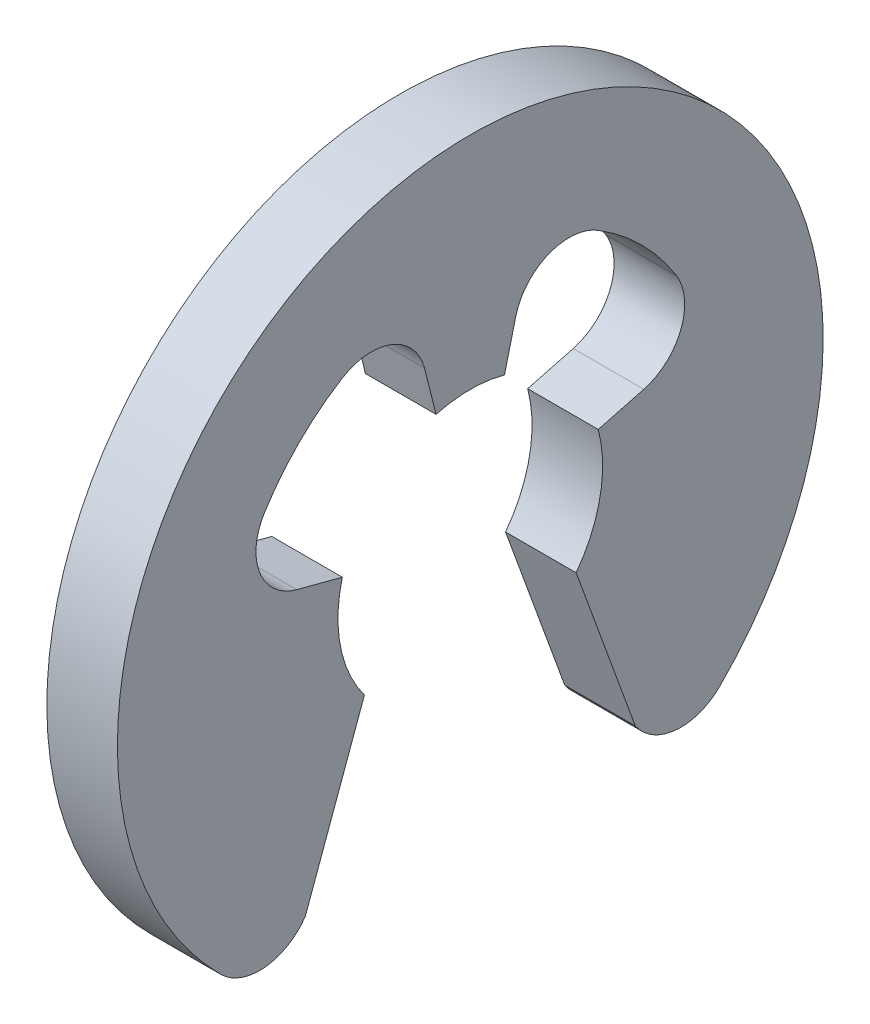
ISO-10303-21;
HEADER;
FILE_DESCRIPTION(('STEP AP214'),'2;1');
FILE_NAME('part.step','',(''),(''),'','','');
FILE_SCHEMA(('AUTOMOTIVE_DESIGN { 1 0 10303 214 1 1 1 1 }'));
ENDSEC;
DATA;
#1=APPLICATION_CONTEXT('core data for automotive mechanical design processes');
#2=APPLICATION_PROTOCOL_DEFINITION('international standard','automotive_design',2000,#1);
#3=PRODUCT_CONTEXT('',#1,'mechanical');
#4=PRODUCT('Part','Part','',(#3));
#5=PRODUCT_RELATED_PRODUCT_CATEGORY('part','',(#4));
#6=PRODUCT_DEFINITION_FORMATION('','',#4);
#7=PRODUCT_DEFINITION_CONTEXT('part definition',#1,'design');
#8=PRODUCT_DEFINITION('design','',#6,#7);
#9=PRODUCT_DEFINITION_SHAPE('','',#8);
#10=(LENGTH_UNIT() NAMED_UNIT(*) SI_UNIT(.MILLI.,.METRE.));
#11=(NAMED_UNIT(*) PLANE_ANGLE_UNIT() SI_UNIT($,.RADIAN.));
#12=(NAMED_UNIT(*) SI_UNIT($,.STERADIAN.) SOLID_ANGLE_UNIT());
#13=UNCERTAINTY_MEASURE_WITH_UNIT(LENGTH_MEASURE(1.E-05),#10,'distance_accuracy_value','');
#14=(GEOMETRIC_REPRESENTATION_CONTEXT(3) GLOBAL_UNCERTAINTY_ASSIGNED_CONTEXT((#13)) GLOBAL_UNIT_ASSIGNED_CONTEXT((#10,
#11,#12)) REPRESENTATION_CONTEXT('',''));
#15=CARTESIAN_POINT('',(0.,0.,0.));
#16=DIRECTION('',(0.,0.,1.));
#17=DIRECTION('',(1.,0.,0.));
#18=AXIS2_PLACEMENT_3D('',#15,#16,#17);
#19=CARTESIAN_POINT('',(0.,0.,0.));
#20=DIRECTION('',(-1.,0.,0.));
#21=DIRECTION('',(0.,0.,1.));
#22=AXIS2_PLACEMENT_3D('',#19,#20,#21);
#23=PLANE('',#22);
#24=CARTESIAN_POINT('',(0.,0.,0.));
#25=DIRECTION('',(-1.,0.,0.));
#26=DIRECTION('',(0.,0.,1.));
#27=AXIS2_PLACEMENT_3D('',#24,#25,#26);
#28=CIRCLE('',#27,0.75);
#29=CARTESIAN_POINT('',(0.,0.190916475736957,0.72529366417485));
#30=VERTEX_POINT('',#29);
#31=CARTESIAN_POINT('',(0.,-0.449999999999999,0.600000000000001));
#32=VERTEX_POINT('',#31);
#33=EDGE_CURVE('E141',#30,#32,#28,.F.);
#34=ORIENTED_EDGE('',*,*,#33,.T.);
#35=DIRECTION('',(0.,-0.939494876468553,0.342562953468903));
#36=VECTOR('',#35,1.);
#37=CARTESIAN_POINT('',(0.,-1.36974839296838,0.935362899612443));
#38=LINE('',#37,#36);
#39=CARTESIAN_POINT('',(0.,-1.36974839296839,0.935362899612445));
#40=VERTEX_POINT('',#39);
#41=EDGE_CURVE('E137',#32,#40,#38,.T.);
#42=ORIENTED_EDGE('',*,*,#41,.T.);
#43=CARTESIAN_POINT('',(0.,-1.1932426932523,1.1932426932523));
#44=DIRECTION('',(-1.,0.,0.));
#45=DIRECTION('',(0.,0.,1.));
#46=AXIS2_PLACEMENT_3D('',#43,#44,#45);
#47=CIRCLE('',#46,0.3125);
#48=CARTESIAN_POINT('',(0.,-1.41421356237309,1.4142135623731));
#49=VERTEX_POINT('',#48);
#50=EDGE_CURVE('E18',#49,#40,#47,.F.);
#51=ORIENTED_EDGE('',*,*,#50,.F.);
#52=CARTESIAN_POINT('',(0.,0.,0.));
#53=DIRECTION('',(-1.,0.,0.));
#54=DIRECTION('',(0.,0.,1.));
#55=AXIS2_PLACEMENT_3D('',#52,#53,#54);
#56=CIRCLE('',#55,2.);
#57=CARTESIAN_POINT('',(0.,-1.41421356237309,-1.4142135623731));
#58=VERTEX_POINT('',#57);
#59=EDGE_CURVE('E213',#58,#49,#56,.F.);
#60=ORIENTED_EDGE('',*,*,#59,.F.);
#61=CARTESIAN_POINT('',(0.,-1.1932426932523,-1.1932426932523));
#62=DIRECTION('',(-1.,0.,0.));
#63=DIRECTION('',(0.,0.,1.));
#64=AXIS2_PLACEMENT_3D('',#61,#62,#63);
#65=CIRCLE('',#64,0.3125);
#66=CARTESIAN_POINT('',(0.,-1.36974839296838,-0.935362899612443));
#67=VERTEX_POINT('',#66);
#68=EDGE_CURVE('E216',#67,#58,#65,.F.);
#69=ORIENTED_EDGE('',*,*,#68,.F.);
#70=DIRECTION('',(0.,0.939494876468553,0.342562953468905));
#71=VECTOR('',#70,1.);
#72=CARTESIAN_POINT('',(0.,-0.45,-0.6));
#73=LINE('',#72,#71);
#74=CARTESIAN_POINT('',(0.,-0.45,-0.6));
#75=VERTEX_POINT('',#74);
#76=EDGE_CURVE('E162',#67,#75,#73,.T.);
#77=ORIENTED_EDGE('',*,*,#76,.T.);
#78=CARTESIAN_POINT('',(0.,0.,0.));
#79=DIRECTION('',(-1.,0.,0.));
#80=DIRECTION('',(0.,0.,1.));
#81=AXIS2_PLACEMENT_3D('',#78,#79,#80);
#82=CIRCLE('',#81,0.75);
#83=CARTESIAN_POINT('',(0.,0.190916475736957,-0.72529366417485));
#84=VERTEX_POINT('',#83);
#85=EDGE_CURVE('E165',#75,#84,#82,.F.);
#86=ORIENTED_EDGE('',*,*,#85,.T.);
#87=DIRECTION('',(0.,0.254555300982609,-0.9670582188998));
#88=VECTOR('',#87,1.);
#89=CARTESIAN_POINT('',(0.,0.258853300319545,-0.983386362794527));
#90=LINE('',#89,#88);
#91=CARTESIAN_POINT('',(0.,0.258853300319545,-0.983386362794527));
#92=VERTEX_POINT('',#91);
#93=EDGE_CURVE('E166',#84,#92,#90,.T.);
#94=ORIENTED_EDGE('',*,*,#93,.T.);
#95=CARTESIAN_POINT('',(0.,0.560705121034879,-0.902505411199989));
#96=DIRECTION('',(-1.,0.,0.));
#97=DIRECTION('',(0.,0.,1.));
#98=AXIS2_PLACEMENT_3D('',#95,#96,#97);
#99=CIRCLE('',#98,0.3125);
#100=CARTESIAN_POINT('',(0.,0.72561839192749,-1.16794817919999));
#101=VERTEX_POINT('',#100);
#102=EDGE_CURVE('E169',#92,#101,#99,.F.);
#103=ORIENTED_EDGE('',*,*,#102,.T.);
#104=CARTESIAN_POINT('',(0.,0.,0.));
#105=DIRECTION('',(-1.,0.,0.));
#106=DIRECTION('',(0.,0.,1.));
#107=AXIS2_PLACEMENT_3D('',#104,#105,#106);
#108=CIRCLE('',#107,1.375);
#109=CARTESIAN_POINT('',(0.,1.16794817919999,-0.72561839192749));
#110=VERTEX_POINT('',#109);
#111=EDGE_CURVE('E223',#101,#110,#108,.F.);
#112=ORIENTED_EDGE('',*,*,#111,.T.);
#113=CARTESIAN_POINT('',(0.,0.902505411199989,-0.560705121034879));
#114=DIRECTION('',(-1.,0.,0.));
#115=DIRECTION('',(0.,0.,1.));
#116=AXIS2_PLACEMENT_3D('',#113,#114,#115);
#117=CIRCLE('',#116,0.3125);
#118=CARTESIAN_POINT('',(0.,0.983386362794527,-0.258853300319545));
#119=VERTEX_POINT('',#118);
#120=EDGE_CURVE('E227',#110,#119,#117,.F.);
#121=ORIENTED_EDGE('',*,*,#120,.T.);
#122=DIRECTION('',(0.,-0.970139398606495,0.242548030854568));
#123=VECTOR('',#122,1.);
#124=CARTESIAN_POINT('',(0.,0.724444369716801,-0.194114283826891));
#125=LINE('',#124,#123);
#126=CARTESIAN_POINT('',(0.,0.724444369716801,-0.194114283826891));
#127=VERTEX_POINT('',#126);
#128=EDGE_CURVE('E170',#119,#127,#125,.T.);
#129=ORIENTED_EDGE('',*,*,#128,.T.);
#130=CARTESIAN_POINT('',(0.,0.,0.));
#131=DIRECTION('',(-1.,0.,0.));
#132=DIRECTION('',(0.,0.,1.));
#133=AXIS2_PLACEMENT_3D('',#130,#131,#132);
#134=CIRCLE('',#133,0.75);
#135=CARTESIAN_POINT('',(0.,0.724444369716801,0.194114283826891));
#136=VERTEX_POINT('',#135);
#137=EDGE_CURVE('E229',#127,#136,#134,.F.);
#138=ORIENTED_EDGE('',*,*,#137,.T.);
#139=DIRECTION('',(0.,0.970139398606495,0.242548030854568));
#140=VECTOR('',#139,1.);
#141=CARTESIAN_POINT('',(0.,0.983386362794527,0.258853300319545));
#142=LINE('',#141,#140);
#143=CARTESIAN_POINT('',(0.,0.983386362794525,0.258853300319544));
#144=VERTEX_POINT('',#143);
#145=EDGE_CURVE('E174',#136,#144,#142,.T.);
#146=ORIENTED_EDGE('',*,*,#145,.T.);
#147=CARTESIAN_POINT('',(0.,0.90250541119999,0.560705121034879));
#148=DIRECTION('',(-1.,0.,0.));
#149=DIRECTION('',(0.,0.,1.));
#150=AXIS2_PLACEMENT_3D('',#147,#148,#149);
#151=CIRCLE('',#150,0.3125);
#152=CARTESIAN_POINT('',(0.,1.16794817919999,0.72561839192749));
#153=VERTEX_POINT('',#152);
#154=EDGE_CURVE('E231',#144,#153,#151,.F.);
#155=ORIENTED_EDGE('',*,*,#154,.T.);
#156=CARTESIAN_POINT('',(0.,0.,0.));
#157=DIRECTION('',(-1.,0.,0.));
#158=DIRECTION('',(0.,0.,1.));
#159=AXIS2_PLACEMENT_3D('',#156,#157,#158);
#160=CIRCLE('',#159,1.375);
#161=CARTESIAN_POINT('',(0.,0.72561839192749,1.16794817919999));
#162=VERTEX_POINT('',#161);
#163=EDGE_CURVE('E234',#153,#162,#160,.F.);
#164=ORIENTED_EDGE('',*,*,#163,.T.);
#165=CARTESIAN_POINT('',(0.,0.560705121034879,0.902505411199989));
#166=DIRECTION('',(-1.,0.,0.));
#167=DIRECTION('',(0.,0.,1.));
#168=AXIS2_PLACEMENT_3D('',#165,#166,#167);
#169=CIRCLE('',#168,0.3125);
#170=CARTESIAN_POINT('',(0.,0.258853300319545,0.983386362794527));
#171=VERTEX_POINT('',#170);
#172=EDGE_CURVE('E236',#162,#171,#169,.F.);
#173=ORIENTED_EDGE('',*,*,#172,.T.);
#174=DIRECTION('',(0.,-0.254555300982609,-0.9670582188998));
#175=VECTOR('',#174,1.);
#176=CARTESIAN_POINT('',(0.,0.,0.));
#177=LINE('',#176,#175);
#178=EDGE_CURVE('E178',#171,#30,#177,.T.);
#179=ORIENTED_EDGE('',*,*,#178,.T.);
#180=EDGE_LOOP('',(#34,#42,#51,#60,#69,#77,#86,#94,#103,#112,#121,#129,#138,#146,#155,#164,#173,#179));
#181=FACE_BOUND('',#180,.T.);
#182=ADVANCED_FACE('F15',(#181),#23,.T.);
#183=CARTESIAN_POINT('',(0.,-1.1932426932523,1.1932426932523));
#184=DIRECTION('',(-1.,0.,0.));
#185=DIRECTION('',(0.,0.,1.));
#186=AXIS2_PLACEMENT_3D('',#183,#184,#185);
#187=CYLINDRICAL_SURFACE('',#186,0.3125);
#188=ORIENTED_EDGE('',*,*,#50,.T.);
#189=DIRECTION('',(1.,0.,0.));
#190=VECTOR('',#189,1.);
#191=CARTESIAN_POINT('',(0.,-1.36974839296838,0.935362899612443));
#192=LINE('',#191,#190);
#193=CARTESIAN_POINT('',(0.4,-1.36974839296839,0.935362899612445));
#194=VERTEX_POINT('',#193);
#195=EDGE_CURVE('E145',#40,#194,#192,.T.);
#196=ORIENTED_EDGE('',*,*,#195,.T.);
#197=CARTESIAN_POINT('',(0.4,-1.1932426932523,1.1932426932523));
#198=DIRECTION('',(-1.,0.,0.));
#199=DIRECTION('',(0.,0.,1.));
#200=AXIS2_PLACEMENT_3D('',#197,#198,#199);
#201=CIRCLE('',#200,0.3125);
#202=CARTESIAN_POINT('',(0.4,-1.41421356237309,1.4142135623731));
#203=VERTEX_POINT('',#202);
#204=EDGE_CURVE('E211',#203,#194,#201,.F.);
#205=ORIENTED_EDGE('',*,*,#204,.F.);
#206=DIRECTION('',(-1.,0.,0.));
#207=VECTOR('',#206,1.);
#208=CARTESIAN_POINT('',(0.2,-1.41421356237309,1.4142135623731));
#209=LINE('',#208,#207);
#210=EDGE_CURVE('E152',#49,#203,#209,.F.);
#211=ORIENTED_EDGE('',*,*,#210,.F.);
#212=EDGE_LOOP('',(#188,#196,#205,#211));
#213=FACE_BOUND('',#212,.T.);
#214=ADVANCED_FACE('F148',(#213),#187,.T.);
#215=CARTESIAN_POINT('',(0.,-1.36974839296838,0.935362899612443));
#216=DIRECTION('',(0.,0.342562953468903,0.939494876468553));
#217=DIRECTION('',(0.,-0.939494876468553,0.342562953468903));
#218=AXIS2_PLACEMENT_3D('',#215,#216,#217);
#219=PLANE('',#218);
#220=ORIENTED_EDGE('',*,*,#195,.F.);
#221=ORIENTED_EDGE('',*,*,#41,.F.);
#222=DIRECTION('',(-1.,0.,0.));
#223=VECTOR('',#222,1.);
#224=CARTESIAN_POINT('',(0.17,-0.45,0.6));
#225=LINE('',#224,#223);
#226=CARTESIAN_POINT('',(0.4,-0.45,0.6));
#227=VERTEX_POINT('',#226);
#228=EDGE_CURVE('E157',#32,#227,#225,.F.);
#229=ORIENTED_EDGE('',*,*,#228,.T.);
#230=DIRECTION('',(0.,0.939494876468552,-0.342562953468905));
#231=VECTOR('',#230,1.);
#232=CARTESIAN_POINT('',(0.4,-1.36974839296838,0.935362899612443));
#233=LINE('',#232,#231);
#234=EDGE_CURVE('E155',#194,#227,#233,.T.);
#235=ORIENTED_EDGE('',*,*,#234,.F.);
#236=EDGE_LOOP('',(#220,#221,#229,#235));
#237=FACE_BOUND('',#236,.T.);
#238=ADVANCED_FACE('F153',(#237),#219,.F.);
#239=CARTESIAN_POINT('',(0.17,0.,0.));
#240=DIRECTION('',(-1.,0.,0.));
#241=DIRECTION('',(0.,0.,1.));
#242=AXIS2_PLACEMENT_3D('',#239,#240,#241);
#243=CYLINDRICAL_SURFACE('',#242,0.75);
#244=ORIENTED_EDGE('',*,*,#33,.F.);
#245=DIRECTION('',(1.,0.,0.));
#246=VECTOR('',#245,1.);
#247=CARTESIAN_POINT('',(0.,0.190916475736957,0.72529366417485));
#248=LINE('',#247,#246);
#249=CARTESIAN_POINT('',(0.4,0.190916475736957,0.72529366417485));
#250=VERTEX_POINT('',#249);
#251=EDGE_CURVE('E179',#30,#250,#248,.T.);
#252=ORIENTED_EDGE('',*,*,#251,.T.);
#253=CARTESIAN_POINT('',(0.4,0.,0.));
#254=DIRECTION('',(-1.,0.,0.));
#255=DIRECTION('',(0.,0.,1.));
#256=AXIS2_PLACEMENT_3D('',#253,#254,#255);
#257=CIRCLE('',#256,0.75);
#258=EDGE_CURVE('E209',#227,#250,#257,.T.);
#259=ORIENTED_EDGE('',*,*,#258,.F.);
#260=ORIENTED_EDGE('',*,*,#228,.F.);
#261=EDGE_LOOP('',(#244,#252,#259,#260));
#262=FACE_BOUND('',#261,.T.);
#263=ADVANCED_FACE('F438',(#262),#243,.F.);
#264=CARTESIAN_POINT('',(0.,0.,0.));
#265=DIRECTION('',(0.,-0.9670582188998,0.254555300982609));
#266=DIRECTION('',(0.,-0.254555300982609,-0.9670582188998));
#267=AXIS2_PLACEMENT_3D('',#264,#265,#266);
#268=PLANE('',#267);
#269=ORIENTED_EDGE('',*,*,#178,.F.);
#270=DIRECTION('',(-1.,0.,0.));
#271=VECTOR('',#270,1.);
#272=CARTESIAN_POINT('',(0.,0.258853300319545,0.983386362794527));
#273=LINE('',#272,#271);
#274=CARTESIAN_POINT('',(0.4,0.258853300319545,0.983386362794527));
#275=VERTEX_POINT('',#274);
#276=EDGE_CURVE('E237',#171,#275,#273,.F.);
#277=ORIENTED_EDGE('',*,*,#276,.T.);
#278=DIRECTION('',(0.,0.254555300982609,0.9670582188998));
#279=VECTOR('',#278,1.);
#280=CARTESIAN_POINT('',(0.4,0.190916475736957,0.72529366417485));
#281=LINE('',#280,#279);
#282=EDGE_CURVE('E208',#250,#275,#281,.T.);
#283=ORIENTED_EDGE('',*,*,#282,.F.);
#284=ORIENTED_EDGE('',*,*,#251,.F.);
#285=EDGE_LOOP('',(#269,#277,#283,#284));
#286=FACE_BOUND('',#285,.T.);
#287=ADVANCED_FACE('F428',(#286),#268,.F.);
#288=CARTESIAN_POINT('',(0.,0.560705121034879,0.902505411199989));
#289=DIRECTION('',(-1.,0.,0.));
#290=DIRECTION('',(0.,0.,1.));
#291=AXIS2_PLACEMENT_3D('',#288,#289,#290);
#292=CYLINDRICAL_SURFACE('',#291,0.3125);
#293=ORIENTED_EDGE('',*,*,#172,.F.);
#294=DIRECTION('',(-1.,0.,0.));
#295=VECTOR('',#294,1.);
#296=CARTESIAN_POINT('',(0.,0.725618391927488,1.16794817919999));
#297=LINE('',#296,#295);
#298=CARTESIAN_POINT('',(0.4,0.72561839192749,1.16794817919999));
#299=VERTEX_POINT('',#298);
#300=EDGE_CURVE('E233',#162,#299,#297,.F.);
#301=ORIENTED_EDGE('',*,*,#300,.T.);
#302=CARTESIAN_POINT('',(0.4,0.560705121034879,0.902505411199989));
#303=DIRECTION('',(-1.,0.,0.));
#304=DIRECTION('',(0.,0.,1.));
#305=AXIS2_PLACEMENT_3D('',#302,#303,#304);
#306=CIRCLE('',#305,0.3125);
#307=EDGE_CURVE('E206',#275,#299,#306,.T.);
#308=ORIENTED_EDGE('',*,*,#307,.F.);
#309=ORIENTED_EDGE('',*,*,#276,.F.);
#310=EDGE_LOOP('',(#293,#301,#308,#309));
#311=FACE_BOUND('',#310,.T.);
#312=ADVANCED_FACE('F418',(#311),#292,.F.);
#313=CARTESIAN_POINT('',(0.,0.,0.));
#314=DIRECTION('',(-1.,0.,0.));
#315=DIRECTION('',(0.,0.,1.));
#316=AXIS2_PLACEMENT_3D('',#313,#314,#315);
#317=CYLINDRICAL_SURFACE('',#316,1.375);
#318=ORIENTED_EDGE('',*,*,#300,.F.);
#319=ORIENTED_EDGE('',*,*,#163,.F.);
#320=DIRECTION('',(-1.,0.,0.));
#321=VECTOR('',#320,1.);
#322=CARTESIAN_POINT('',(0.,1.16794817919999,0.725618391927489));
#323=LINE('',#322,#321);
#324=CARTESIAN_POINT('',(0.4,1.16794817919999,0.72561839192749));
#325=VERTEX_POINT('',#324);
#326=EDGE_CURVE('E177',#153,#325,#323,.F.);
#327=ORIENTED_EDGE('',*,*,#326,.T.);
#328=CARTESIAN_POINT('',(0.4,0.,0.));
#329=DIRECTION('',(-1.,0.,0.));
#330=DIRECTION('',(0.,0.,1.));
#331=AXIS2_PLACEMENT_3D('',#328,#329,#330);
#332=CIRCLE('',#331,1.375);
#333=EDGE_CURVE('E203',#299,#325,#332,.T.);
#334=ORIENTED_EDGE('',*,*,#333,.F.);
#335=EDGE_LOOP('',(#318,#319,#327,#334));
#336=FACE_BOUND('',#335,.T.);
#337=ADVANCED_FACE('F408',(#336),#317,.F.);
#338=CARTESIAN_POINT('',(0.,0.90250541119999,0.560705121034879));
#339=DIRECTION('',(-1.,0.,0.));
#340=DIRECTION('',(0.,0.,1.));
#341=AXIS2_PLACEMENT_3D('',#338,#339,#340);
#342=CYLINDRICAL_SURFACE('',#341,0.3125);
#343=ORIENTED_EDGE('',*,*,#326,.F.);
#344=ORIENTED_EDGE('',*,*,#154,.F.);
#345=DIRECTION('',(1.,0.,0.));
#346=VECTOR('',#345,1.);
#347=CARTESIAN_POINT('',(0.,0.983386362794527,0.258853300319545));
#348=LINE('',#347,#346);
#349=CARTESIAN_POINT('',(0.4,0.983386362794528,0.258853300319545));
#350=VERTEX_POINT('',#349);
#351=EDGE_CURVE('E176',#144,#350,#348,.T.);
#352=ORIENTED_EDGE('',*,*,#351,.T.);
#353=CARTESIAN_POINT('',(0.4,0.90250541119999,0.560705121034879));
#354=DIRECTION('',(-1.,0.,0.));
#355=DIRECTION('',(0.,0.,1.));
#356=AXIS2_PLACEMENT_3D('',#353,#354,#355);
#357=CIRCLE('',#356,0.3125);
#358=EDGE_CURVE('E200',#325,#350,#357,.T.);
#359=ORIENTED_EDGE('',*,*,#358,.F.);
#360=EDGE_LOOP('',(#343,#344,#352,#359));
#361=FACE_BOUND('',#360,.T.);
#362=ADVANCED_FACE('F398',(#361),#342,.F.);
#363=CARTESIAN_POINT('',(0.,0.983386362794527,0.258853300319545));
#364=DIRECTION('',(0.,0.242548030854568,-0.970139398606495));
#365=DIRECTION('',(0.,0.970139398606495,0.242548030854568));
#366=AXIS2_PLACEMENT_3D('',#363,#364,#365);
#367=PLANE('',#366);
#368=ORIENTED_EDGE('',*,*,#351,.F.);
#369=ORIENTED_EDGE('',*,*,#145,.F.);
#370=DIRECTION('',(-1.,0.,0.));
#371=VECTOR('',#370,1.);
#372=CARTESIAN_POINT('',(0.17,0.724444369716801,0.194114283826891));
#373=LINE('',#372,#371);
#374=CARTESIAN_POINT('',(0.4,0.724444369716801,0.194114283826891));
#375=VERTEX_POINT('',#374);
#376=EDGE_CURVE('E173',#136,#375,#373,.F.);
#377=ORIENTED_EDGE('',*,*,#376,.T.);
#378=DIRECTION('',(0.,-0.970139398606495,-0.242548030854567));
#379=VECTOR('',#378,1.);
#380=CARTESIAN_POINT('',(0.4,0.983386362794527,0.258853300319545));
#381=LINE('',#380,#379);
#382=EDGE_CURVE('E199',#350,#375,#381,.T.);
#383=ORIENTED_EDGE('',*,*,#382,.F.);
#384=EDGE_LOOP('',(#368,#369,#377,#383));
#385=FACE_BOUND('',#384,.T.);
#386=ADVANCED_FACE('F388',(#385),#367,.F.);
#387=CARTESIAN_POINT('',(0.17,0.,0.));
#388=DIRECTION('',(-1.,0.,0.));
#389=DIRECTION('',(0.,0.,1.));
#390=AXIS2_PLACEMENT_3D('',#387,#388,#389);
#391=CYLINDRICAL_SURFACE('',#390,0.75);
#392=ORIENTED_EDGE('',*,*,#137,.F.);
#393=DIRECTION('',(1.,0.,0.));
#394=VECTOR('',#393,1.);
#395=CARTESIAN_POINT('',(0.,0.724444369716801,-0.194114283826891));
#396=LINE('',#395,#394);
#397=CARTESIAN_POINT('',(0.4,0.724444369716801,-0.194114283826891));
#398=VERTEX_POINT('',#397);
#399=EDGE_CURVE('E172',#127,#398,#396,.T.);
#400=ORIENTED_EDGE('',*,*,#399,.T.);
#401=CARTESIAN_POINT('',(0.4,0.,0.));
#402=DIRECTION('',(-1.,0.,0.));
#403=DIRECTION('',(0.,0.,1.));
#404=AXIS2_PLACEMENT_3D('',#401,#402,#403);
#405=CIRCLE('',#404,0.75);
#406=EDGE_CURVE('E196',#375,#398,#405,.T.);
#407=ORIENTED_EDGE('',*,*,#406,.F.);
#408=ORIENTED_EDGE('',*,*,#376,.F.);
#409=EDGE_LOOP('',(#392,#400,#407,#408));
#410=FACE_BOUND('',#409,.T.);
#411=ADVANCED_FACE('F378',(#410),#391,.F.);
#412=CARTESIAN_POINT('',(0.,0.724444369716801,-0.194114283826891));
#413=DIRECTION('',(0.,0.242548030854568,0.970139398606495));
#414=DIRECTION('',(0.,-0.970139398606495,0.242548030854568));
#415=AXIS2_PLACEMENT_3D('',#412,#413,#414);
#416=PLANE('',#415);
#417=ORIENTED_EDGE('',*,*,#399,.F.);
#418=ORIENTED_EDGE('',*,*,#128,.F.);
#419=DIRECTION('',(-1.,0.,0.));
#420=VECTOR('',#419,1.);
#421=CARTESIAN_POINT('',(0.,0.983386362794527,-0.258853300319545));
#422=LINE('',#421,#420);
#423=CARTESIAN_POINT('',(0.4,0.98338636279452,-0.258853300319543));
#424=VERTEX_POINT('',#423);
#425=EDGE_CURVE('E226',#119,#424,#422,.F.);
#426=ORIENTED_EDGE('',*,*,#425,.T.);
#427=DIRECTION('',(0.,0.970139398606495,-0.242548030854567));
#428=VECTOR('',#427,1.);
#429=CARTESIAN_POINT('',(0.4,0.724444369716801,-0.194114283826891));
#430=LINE('',#429,#428);
#431=EDGE_CURVE('E195',#398,#424,#430,.T.);
#432=ORIENTED_EDGE('',*,*,#431,.F.);
#433=EDGE_LOOP('',(#417,#418,#426,#432));
#434=FACE_BOUND('',#433,.T.);
#435=ADVANCED_FACE('F368',(#434),#416,.F.);
#436=CARTESIAN_POINT('',(0.,0.902505411199989,-0.560705121034879));
#437=DIRECTION('',(-1.,0.,0.));
#438=DIRECTION('',(0.,0.,1.));
#439=AXIS2_PLACEMENT_3D('',#436,#437,#438);
#440=CYLINDRICAL_SURFACE('',#439,0.3125);
#441=ORIENTED_EDGE('',*,*,#425,.F.);
#442=ORIENTED_EDGE('',*,*,#120,.F.);
#443=DIRECTION('',(-1.,0.,0.));
#444=VECTOR('',#443,1.);
#445=CARTESIAN_POINT('',(0.,1.16794817919999,-0.725618391927488));
#446=LINE('',#445,#444);
#447=CARTESIAN_POINT('',(0.4,1.16794817919999,-0.72561839192749));
#448=VERTEX_POINT('',#447);
#449=EDGE_CURVE('E225',#110,#448,#446,.F.);
#450=ORIENTED_EDGE('',*,*,#449,.T.);
#451=CARTESIAN_POINT('',(0.4,0.902505411199989,-0.560705121034879));
#452=DIRECTION('',(-1.,0.,0.));
#453=DIRECTION('',(0.,0.,1.));
#454=AXIS2_PLACEMENT_3D('',#451,#452,#453);
#455=CIRCLE('',#454,0.3125);
#456=EDGE_CURVE('E192',#424,#448,#455,.T.);
#457=ORIENTED_EDGE('',*,*,#456,.F.);
#458=EDGE_LOOP('',(#441,#442,#450,#457));
#459=FACE_BOUND('',#458,.T.);
#460=ADVANCED_FACE('F358',(#459),#440,.F.);
#461=CARTESIAN_POINT('',(0.,0.,0.));
#462=DIRECTION('',(-1.,0.,0.));
#463=DIRECTION('',(0.,0.,1.));
#464=AXIS2_PLACEMENT_3D('',#461,#462,#463);
#465=CYLINDRICAL_SURFACE('',#464,1.375);
#466=ORIENTED_EDGE('',*,*,#449,.F.);
#467=ORIENTED_EDGE('',*,*,#111,.F.);
#468=DIRECTION('',(-1.,0.,0.));
#469=VECTOR('',#468,1.);
#470=CARTESIAN_POINT('',(0.,0.725618391927488,-1.16794817919999));
#471=LINE('',#470,#469);
#472=CARTESIAN_POINT('',(0.4,0.72561839192749,-1.16794817919999));
#473=VERTEX_POINT('',#472);
#474=EDGE_CURVE('E222',#101,#473,#471,.F.);
#475=ORIENTED_EDGE('',*,*,#474,.T.);
#476=CARTESIAN_POINT('',(0.4,0.,0.));
#477=DIRECTION('',(-1.,0.,0.));
#478=DIRECTION('',(0.,0.,1.));
#479=AXIS2_PLACEMENT_3D('',#476,#477,#478);
#480=CIRCLE('',#479,1.375);
#481=EDGE_CURVE('E189',#448,#473,#480,.T.);
#482=ORIENTED_EDGE('',*,*,#481,.F.);
#483=EDGE_LOOP('',(#466,#467,#475,#482));
#484=FACE_BOUND('',#483,.T.);
#485=ADVANCED_FACE('F348',(#484),#465,.F.);
#486=CARTESIAN_POINT('',(0.,0.560705121034879,-0.902505411199989));
#487=DIRECTION('',(-1.,0.,0.));
#488=DIRECTION('',(0.,0.,1.));
#489=AXIS2_PLACEMENT_3D('',#486,#487,#488);
#490=CYLINDRICAL_SURFACE('',#489,0.3125);
#491=ORIENTED_EDGE('',*,*,#102,.F.);
#492=DIRECTION('',(1.,0.,0.));
#493=VECTOR('',#492,1.);
#494=CARTESIAN_POINT('',(0.,0.258853300319545,-0.983386362794527));
#495=LINE('',#494,#493);
#496=CARTESIAN_POINT('',(0.4,0.258853300319545,-0.983386362794527));
#497=VERTEX_POINT('',#496);
#498=EDGE_CURVE('E168',#92,#497,#495,.T.);
#499=ORIENTED_EDGE('',*,*,#498,.T.);
#500=CARTESIAN_POINT('',(0.4,0.560705121034879,-0.902505411199989));
#501=DIRECTION('',(-1.,0.,0.));
#502=DIRECTION('',(0.,0.,1.));
#503=AXIS2_PLACEMENT_3D('',#500,#501,#502);
#504=CIRCLE('',#503,0.3125);
#505=EDGE_CURVE('E187',#473,#497,#504,.T.);
#506=ORIENTED_EDGE('',*,*,#505,.F.);
#507=ORIENTED_EDGE('',*,*,#474,.F.);
#508=EDGE_LOOP('',(#491,#499,#506,#507));
#509=FACE_BOUND('',#508,.T.);
#510=ADVANCED_FACE('F338',(#509),#490,.F.);
#511=CARTESIAN_POINT('',(0.,0.258853300319545,-0.983386362794527));
#512=DIRECTION('',(0.,-0.9670582188998,-0.254555300982609));
#513=DIRECTION('',(0.,0.254555300982609,-0.9670582188998));
#514=AXIS2_PLACEMENT_3D('',#511,#512,#513);
#515=PLANE('',#514);
#516=DIRECTION('',(0.,-0.254555300982609,0.9670582188998));
#517=VECTOR('',#516,1.);
#518=CARTESIAN_POINT('',(0.4,0.258853300319545,-0.983386362794527));
#519=LINE('',#518,#517);
#520=CARTESIAN_POINT('',(0.4,0.190916475736957,-0.72529366417485));
#521=VERTEX_POINT('',#520);
#522=EDGE_CURVE('E186',#497,#521,#519,.T.);
#523=ORIENTED_EDGE('',*,*,#522,.F.);
#524=ORIENTED_EDGE('',*,*,#498,.F.);
#525=ORIENTED_EDGE('',*,*,#93,.F.);
#526=DIRECTION('',(-1.,0.,0.));
#527=VECTOR('',#526,1.);
#528=CARTESIAN_POINT('',(0.17,0.190916475736957,-0.72529366417485));
#529=LINE('',#528,#527);
#530=EDGE_CURVE('E220',#84,#521,#529,.F.);
#531=ORIENTED_EDGE('',*,*,#530,.T.);
#532=EDGE_LOOP('',(#523,#524,#525,#531));
#533=FACE_BOUND('',#532,.T.);
#534=ADVANCED_FACE('F328',(#533),#515,.F.);
#535=CARTESIAN_POINT('',(0.17,0.,0.));
#536=DIRECTION('',(-1.,0.,0.));
#537=DIRECTION('',(0.,0.,1.));
#538=AXIS2_PLACEMENT_3D('',#535,#536,#537);
#539=CYLINDRICAL_SURFACE('',#538,0.75);
#540=ORIENTED_EDGE('',*,*,#85,.F.);
#541=DIRECTION('',(1.,0.,0.));
#542=VECTOR('',#541,1.);
#543=CARTESIAN_POINT('',(0.,-0.45,-0.6));
#544=LINE('',#543,#542);
#545=CARTESIAN_POINT('',(0.4,-0.45,-0.6));
#546=VERTEX_POINT('',#545);
#547=EDGE_CURVE('E164',#75,#546,#544,.T.);
#548=ORIENTED_EDGE('',*,*,#547,.T.);
#549=CARTESIAN_POINT('',(0.4,0.,0.));
#550=DIRECTION('',(-1.,0.,0.));
#551=DIRECTION('',(0.,0.,1.));
#552=AXIS2_PLACEMENT_3D('',#549,#550,#551);
#553=CIRCLE('',#552,0.75);
#554=EDGE_CURVE('E184',#521,#546,#553,.T.);
#555=ORIENTED_EDGE('',*,*,#554,.F.);
#556=ORIENTED_EDGE('',*,*,#530,.F.);
#557=EDGE_LOOP('',(#540,#548,#555,#556));
#558=FACE_BOUND('',#557,.T.);
#559=ADVANCED_FACE('F294',(#558),#539,.F.);
#560=CARTESIAN_POINT('',(0.,-0.45,-0.6));
#561=DIRECTION('',(0.,0.342562953468905,-0.939494876468553));
#562=DIRECTION('',(0.,0.939494876468553,0.342562953468905));
#563=AXIS2_PLACEMENT_3D('',#560,#561,#562);
#564=PLANE('',#563);
#565=ORIENTED_EDGE('',*,*,#547,.F.);
#566=ORIENTED_EDGE('',*,*,#76,.F.);
#567=DIRECTION('',(-1.,0.,0.));
#568=VECTOR('',#567,1.);
#569=CARTESIAN_POINT('',(0.,-1.36974839296838,-0.935362899612441));
#570=LINE('',#569,#568);
#571=CARTESIAN_POINT('',(0.4,-1.36974839296839,-0.935362899612444));
#572=VERTEX_POINT('',#571);
#573=EDGE_CURVE('E218',#572,#67,#570,.T.);
#574=ORIENTED_EDGE('',*,*,#573,.F.);
#575=DIRECTION('',(0.,-0.939494876468552,-0.342562953468905));
#576=VECTOR('',#575,1.);
#577=CARTESIAN_POINT('',(0.4,-0.45,-0.6));
#578=LINE('',#577,#576);
#579=EDGE_CURVE('E183',#546,#572,#578,.T.);
#580=ORIENTED_EDGE('',*,*,#579,.F.);
#581=EDGE_LOOP('',(#565,#566,#574,#580));
#582=FACE_BOUND('',#581,.T.);
#583=ADVANCED_FACE('F281',(#582),#564,.F.);
#584=CARTESIAN_POINT('',(0.,-1.1932426932523,-1.1932426932523));
#585=DIRECTION('',(-1.,0.,0.));
#586=DIRECTION('',(0.,0.,1.));
#587=AXIS2_PLACEMENT_3D('',#584,#585,#586);
#588=CYLINDRICAL_SURFACE('',#587,0.3125);
#589=ORIENTED_EDGE('',*,*,#68,.T.);
#590=DIRECTION('',(-1.,0.,0.));
#591=VECTOR('',#590,1.);
#592=CARTESIAN_POINT('',(0.2,-1.41421356237309,-1.4142135623731));
#593=LINE('',#592,#591);
#594=CARTESIAN_POINT('',(0.4,-1.41421356237309,-1.4142135623731));
#595=VERTEX_POINT('',#594);
#596=EDGE_CURVE('E33',#595,#58,#593,.T.);
#597=ORIENTED_EDGE('',*,*,#596,.F.);
#598=CARTESIAN_POINT('',(0.4,-1.1932426932523,-1.1932426932523));
#599=DIRECTION('',(-1.,0.,0.));
#600=DIRECTION('',(0.,0.,1.));
#601=AXIS2_PLACEMENT_3D('',#598,#599,#600);
#602=CIRCLE('',#601,0.3125);
#603=EDGE_CURVE('E24',#572,#595,#602,.F.);
#604=ORIENTED_EDGE('',*,*,#603,.F.);
#605=ORIENTED_EDGE('',*,*,#573,.T.);
#606=EDGE_LOOP('',(#589,#597,#604,#605));
#607=FACE_BOUND('',#606,.T.);
#608=ADVANCED_FACE('F283',(#607),#588,.T.);
#609=CARTESIAN_POINT('',(0.2,0.,0.));
#610=DIRECTION('',(-1.,0.,0.));
#611=DIRECTION('',(0.,0.,1.));
#612=AXIS2_PLACEMENT_3D('',#609,#610,#611);
#613=CYLINDRICAL_SURFACE('',#612,2.);
#614=ORIENTED_EDGE('',*,*,#210,.T.);
#615=CARTESIAN_POINT('',(0.4,0.,0.));
#616=DIRECTION('',(-1.,0.,0.));
#617=DIRECTION('',(0.,0.,1.));
#618=AXIS2_PLACEMENT_3D('',#615,#616,#617);
#619=CIRCLE('',#618,2.);
#620=EDGE_CURVE('E10',#595,#203,#619,.F.);
#621=ORIENTED_EDGE('',*,*,#620,.F.);
#622=ORIENTED_EDGE('',*,*,#596,.T.);
#623=ORIENTED_EDGE('',*,*,#59,.T.);
#624=EDGE_LOOP('',(#614,#621,#622,#623));
#625=FACE_BOUND('',#624,.T.);
#626=ADVANCED_FACE('F285',(#625),#613,.T.);
#627=CARTESIAN_POINT('',(0.4,0.,0.));
#628=DIRECTION('',(1.,0.,0.));
#629=DIRECTION('',(0.,0.,-1.));
#630=AXIS2_PLACEMENT_3D('',#627,#628,#629);
#631=PLANE('',#630);
#632=ORIENTED_EDGE('',*,*,#620,.T.);
#633=ORIENTED_EDGE('',*,*,#204,.T.);
#634=ORIENTED_EDGE('',*,*,#234,.T.);
#635=ORIENTED_EDGE('',*,*,#258,.T.);
#636=ORIENTED_EDGE('',*,*,#282,.T.);
#637=ORIENTED_EDGE('',*,*,#307,.T.);
#638=ORIENTED_EDGE('',*,*,#333,.T.);
#639=ORIENTED_EDGE('',*,*,#358,.T.);
#640=ORIENTED_EDGE('',*,*,#382,.T.);
#641=ORIENTED_EDGE('',*,*,#406,.T.);
#642=ORIENTED_EDGE('',*,*,#431,.T.);
#643=ORIENTED_EDGE('',*,*,#456,.T.);
#644=ORIENTED_EDGE('',*,*,#481,.T.);
#645=ORIENTED_EDGE('',*,*,#505,.T.);
#646=ORIENTED_EDGE('',*,*,#522,.T.);
#647=ORIENTED_EDGE('',*,*,#554,.T.);
#648=ORIENTED_EDGE('',*,*,#579,.T.);
#649=ORIENTED_EDGE('',*,*,#603,.T.);
#650=EDGE_LOOP('',(#632,#633,#634,#635,#636,#637,#638,#639,#640,#641,#642,#643,#644,#645,#646,
#647,#648,#649));
#651=FACE_BOUND('',#650,.T.);
#652=ADVANCED_FACE('F277',(#651),#631,.T.);
#653=CLOSED_SHELL('',(#182,#214,#238,#263,#287,#312,#337,#362,#386,#411,#435,#460,#485,#510,
#534,#559,#583,#608,#626,#652));
#654=MANIFOLD_SOLID_BREP('B1',#653);
#655=ADVANCED_BREP_SHAPE_REPRESENTATION('',(#18,#654),#14);
#656=SHAPE_DEFINITION_REPRESENTATION(#9,#655);
ENDSEC;
END-ISO-10303-21;
